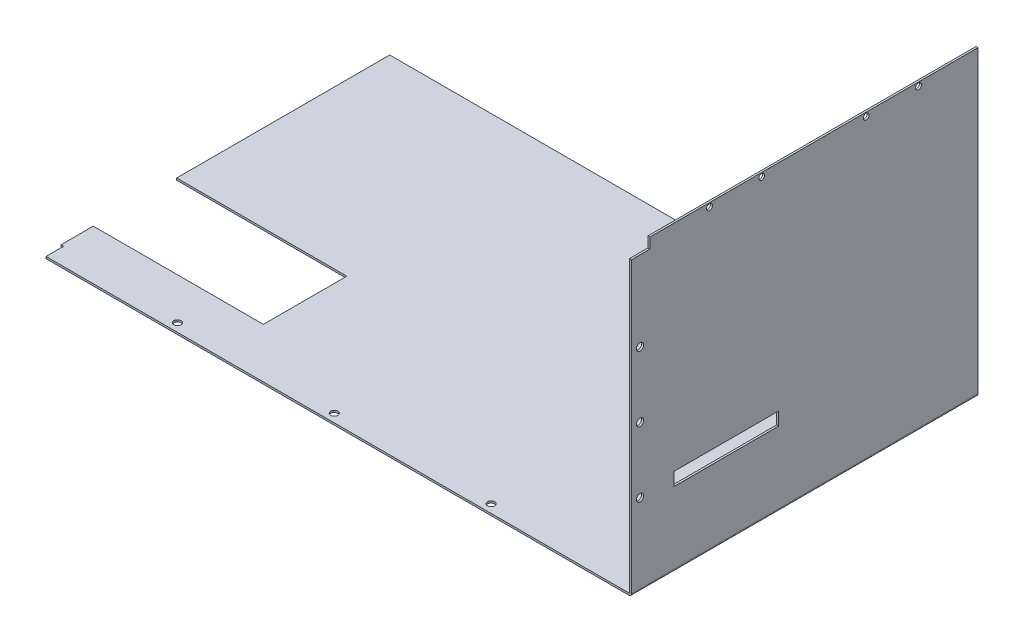
ISO-10303-21;
HEADER;
FILE_DESCRIPTION(('STEP AP214'),'2;1');
FILE_NAME('part.step','',(''),(''),'','','');
FILE_SCHEMA(('AUTOMOTIVE_DESIGN { 1 0 10303 214 1 1 1 1 }'));
ENDSEC;
DATA;
#1=APPLICATION_CONTEXT('core data for automotive mechanical design processes');
#2=APPLICATION_PROTOCOL_DEFINITION('international standard','automotive_design',2000,#1);
#3=PRODUCT_CONTEXT('',#1,'mechanical');
#4=PRODUCT('Part','Part','',(#3));
#5=PRODUCT_RELATED_PRODUCT_CATEGORY('part','',(#4));
#6=PRODUCT_DEFINITION_FORMATION('','',#4);
#7=PRODUCT_DEFINITION_CONTEXT('part definition',#1,'design');
#8=PRODUCT_DEFINITION('design','',#6,#7);
#9=PRODUCT_DEFINITION_SHAPE('','',#8);
#10=(LENGTH_UNIT() NAMED_UNIT(*) SI_UNIT(.MILLI.,.METRE.));
#11=(NAMED_UNIT(*) PLANE_ANGLE_UNIT() SI_UNIT($,.RADIAN.));
#12=(NAMED_UNIT(*) SI_UNIT($,.STERADIAN.) SOLID_ANGLE_UNIT());
#13=UNCERTAINTY_MEASURE_WITH_UNIT(LENGTH_MEASURE(1.E-05),#10,'distance_accuracy_value','');
#14=(GEOMETRIC_REPRESENTATION_CONTEXT(3) GLOBAL_UNCERTAINTY_ASSIGNED_CONTEXT((#13)) GLOBAL_UNIT_ASSIGNED_CONTEXT((#10,
#11,#12)) REPRESENTATION_CONTEXT('',''));
#15=CARTESIAN_POINT('',(0.,0.,0.));
#16=DIRECTION('',(0.,0.,1.));
#17=DIRECTION('',(1.,0.,0.));
#18=AXIS2_PLACEMENT_3D('',#15,#16,#17);
#19=CARTESIAN_POINT('',(0.,0.,265.));
#20=DIRECTION('',(0.,0.,1.));
#21=DIRECTION('',(1.,0.,0.));
#22=AXIS2_PLACEMENT_3D('',#19,#20,#21);
#23=PLANE('',#22);
#24=DIRECTION('',(-1.,0.,0.));
#25=VECTOR('',#24,1.);
#26=CARTESIAN_POINT('',(0.,1.5,265.));
#27=LINE('',#26,#25);
#28=CARTESIAN_POINT('',(-446.67,1.49999999999843,265.));
#29=VERTEX_POINT('',#28);
#30=CARTESIAN_POINT('',(-0.736599999999997,1.5,265.));
#31=VERTEX_POINT('',#30);
#32=EDGE_CURVE('E287',#29,#31,#27,.F.);
#33=ORIENTED_EDGE('',*,*,#32,.F.);
#34=DIRECTION('',(0.,1.,0.));
#35=VECTOR('',#34,1.);
#36=CARTESIAN_POINT('',(-446.67,1.49999999999843,265.));
#37=LINE('',#36,#35);
#38=CARTESIAN_POINT('',(-446.67,-1.55953996962106E-12,265.));
#39=VERTEX_POINT('',#38);
#40=EDGE_CURVE('E210',#29,#39,#37,.F.);
#41=ORIENTED_EDGE('',*,*,#40,.T.);
#42=DIRECTION('',(1.,0.,0.));
#43=VECTOR('',#42,1.);
#44=CARTESIAN_POINT('',(0.,0.,265.));
#45=LINE('',#44,#43);
#46=CARTESIAN_POINT('',(-0.736599999999992,0.,265.));
#47=VERTEX_POINT('',#46);
#48=EDGE_CURVE('E215',#39,#47,#45,.T.);
#49=ORIENTED_EDGE('',*,*,#48,.T.);
#50=DIRECTION('',(0.,-1.,0.));
#51=VECTOR('',#50,1.);
#52=CARTESIAN_POINT('',(-0.736599999999997,1.5,265.));
#53=LINE('',#52,#51);
#54=EDGE_CURVE('E295',#31,#47,#53,.T.);
#55=ORIENTED_EDGE('',*,*,#54,.F.);
#56=EDGE_LOOP('',(#33,#41,#49,#55));
#57=FACE_BOUND('',#56,.T.);
#58=ADVANCED_FACE('F56',(#57),#23,.T.);
#59=CARTESIAN_POINT('',(0.,0.,0.));
#60=DIRECTION('',(0.,-1.,0.));
#61=DIRECTION('',(1.,0.,0.));
#62=AXIS2_PLACEMENT_3D('',#59,#60,#61);
#63=PLANE('',#62);
#64=CARTESIAN_POINT('',(-232.4684,-8.11659080470722E-13,258.618299999999));
#65=DIRECTION('',(0.,-1.,0.));
#66=DIRECTION('',(1.,0.,0.));
#67=AXIS2_PLACEMENT_3D('',#64,#65,#66);
#68=CIRCLE('',#67,2.75000000000001);
#69=CARTESIAN_POINT('',(-229.7184,-8.02057506788903E-13,258.618299999999));
#70=VERTEX_POINT('',#69);
#71=EDGE_CURVE('E225',#70,#70,#68,.T.);
#72=ORIENTED_EDGE('',*,*,#71,.F.);
#73=EDGE_LOOP('',(#72));
#74=FACE_BOUND('',#73,.T.);
#75=CARTESIAN_POINT('',(-112.4684,-3.92681319809546E-13,258.618299999999));
#76=DIRECTION('',(0.,-1.,0.));
#77=DIRECTION('',(1.,0.,0.));
#78=AXIS2_PLACEMENT_3D('',#75,#76,#77);
#79=CIRCLE('',#78,2.75000000000001);
#80=CARTESIAN_POINT('',(-109.7184,-3.83079746127727E-13,258.618299999999));
#81=VERTEX_POINT('',#80);
#82=EDGE_CURVE('E223',#81,#81,#79,.T.);
#83=ORIENTED_EDGE('',*,*,#82,.F.);
#84=EDGE_LOOP('',(#83));
#85=FACE_BOUND('',#84,.T.);
#86=CARTESIAN_POINT('',(-352.4684,-1.2306368411319E-12,258.6183));
#87=DIRECTION('',(0.,-1.,0.));
#88=DIRECTION('',(1.,0.,0.));
#89=AXIS2_PLACEMENT_3D('',#86,#87,#88);
#90=CIRCLE('',#89,2.74999999999998);
#91=CARTESIAN_POINT('',(-349.7184,-1.22103526745008E-12,258.6183));
#92=VERTEX_POINT('',#91);
#93=EDGE_CURVE('E231',#92,#92,#90,.T.);
#94=ORIENTED_EDGE('',*,*,#93,.F.);
#95=EDGE_LOOP('',(#94));
#96=FACE_BOUND('',#95,.T.);
#97=ORIENTED_EDGE('',*,*,#48,.F.);
#98=DIRECTION('',(0.,0.,1.));
#99=VECTOR('',#98,1.);
#100=CARTESIAN_POINT('',(-446.67,-1.55953996962106E-12,0.));
#101=LINE('',#100,#99);
#102=CARTESIAN_POINT('',(-446.67,-1.55953996962106E-12,251.509899070925));
#103=VERTEX_POINT('',#102);
#104=EDGE_CURVE('E203',#39,#103,#101,.F.);
#105=ORIENTED_EDGE('',*,*,#104,.T.);
#106=DIRECTION('',(1.,0.,0.));
#107=VECTOR('',#106,1.);
#108=CARTESIAN_POINT('',(0.,0.,251.509899070925));
#109=LINE('',#108,#107);
#110=CARTESIAN_POINT('',(-448.67,-1.56652293229875E-12,251.509899070925));
#111=VERTEX_POINT('',#110);
#112=EDGE_CURVE('E194',#103,#111,#109,.F.);
#113=ORIENTED_EDGE('',*,*,#112,.T.);
#114=DIRECTION('',(0.,0.,1.));
#115=VECTOR('',#114,1.);
#116=CARTESIAN_POINT('',(-448.67,-1.56652293229875E-12,265.));
#117=LINE('',#116,#115);
#118=CARTESIAN_POINT('',(-448.67,-1.56652293229875E-12,226.83435698));
#119=VERTEX_POINT('',#118);
#120=EDGE_CURVE('E252',#119,#111,#117,.T.);
#121=ORIENTED_EDGE('',*,*,#120,.F.);
#122=DIRECTION('',(1.,0.,0.));
#123=VECTOR('',#122,1.);
#124=CARTESIAN_POINT('',(-448.67,-1.56652293229875E-12,226.83435698));
#125=LINE('',#124,#123);
#126=CARTESIAN_POINT('',(-318.5,-1.11203680642154E-12,226.83435698));
#127=VERTEX_POINT('',#126);
#128=EDGE_CURVE('E254',#119,#127,#125,.T.);
#129=ORIENTED_EDGE('',*,*,#128,.T.);
#130=DIRECTION('',(0.,0.,1.));
#131=VECTOR('',#130,1.);
#132=CARTESIAN_POINT('',(-318.5,-1.11203680642154E-12,265.));
#133=LINE('',#132,#131);
#134=CARTESIAN_POINT('',(-318.5,-1.11203680642154E-12,163.));
#135=VERTEX_POINT('',#134);
#136=EDGE_CURVE('E283',#135,#127,#133,.T.);
#137=ORIENTED_EDGE('',*,*,#136,.F.);
#138=DIRECTION('',(1.,0.,0.));
#139=VECTOR('',#138,1.);
#140=CARTESIAN_POINT('',(-448.67,-1.56652293229875E-12,163.));
#141=LINE('',#140,#139);
#142=CARTESIAN_POINT('',(-448.67,-1.56652293229875E-12,163.));
#143=VERTEX_POINT('',#142);
#144=EDGE_CURVE('E277',#143,#135,#141,.T.);
#145=ORIENTED_EDGE('',*,*,#144,.F.);
#146=DIRECTION('',(0.,0.,1.));
#147=VECTOR('',#146,1.);
#148=CARTESIAN_POINT('',(-448.67,-1.56652293229875E-12,0.));
#149=LINE('',#148,#147);
#150=CARTESIAN_POINT('',(-448.67,-1.56652293229875E-12,0.));
#151=VERTEX_POINT('',#150);
#152=EDGE_CURVE('E265',#151,#143,#149,.T.);
#153=ORIENTED_EDGE('',*,*,#152,.F.);
#154=DIRECTION('',(-1.,0.,0.));
#155=VECTOR('',#154,1.);
#156=CARTESIAN_POINT('',(-318.5,-1.11203680642154E-12,0.));
#157=LINE('',#156,#155);
#158=CARTESIAN_POINT('',(-0.736599999999992,0.,0.));
#159=VERTEX_POINT('',#158);
#160=EDGE_CURVE('E285',#159,#151,#157,.T.);
#161=ORIENTED_EDGE('',*,*,#160,.F.);
#162=DIRECTION('',(0.,0.,1.));
#163=VECTOR('',#162,1.);
#164=CARTESIAN_POINT('',(-0.736599999999992,0.,0.));
#165=LINE('',#164,#163);
#166=EDGE_CURVE('E293',#159,#47,#165,.T.);
#167=ORIENTED_EDGE('',*,*,#166,.T.);
#168=EDGE_LOOP('',(#97,#105,#113,#121,#129,#137,#145,#153,#161,#167));
#169=FACE_BOUND('',#168,.T.);
#170=ADVANCED_FACE('F213',(#74,#85,#96,#169),#63,.T.);
#171=CARTESIAN_POINT('',(0.,1.5,0.));
#172=DIRECTION('',(0.,-1.,0.));
#173=DIRECTION('',(1.,0.,0.));
#174=AXIS2_PLACEMENT_3D('',#171,#172,#173);
#175=PLANE('',#174);
#176=CARTESIAN_POINT('',(-352.4684,1.49999999999877,258.6183));
#177=DIRECTION('',(0.,-1.,0.));
#178=DIRECTION('',(1.,0.,0.));
#179=AXIS2_PLACEMENT_3D('',#176,#177,#178);
#180=CIRCLE('',#179,2.74999999999998);
#181=CARTESIAN_POINT('',(-349.7184,1.49999999999878,258.6183));
#182=VERTEX_POINT('',#181);
#183=EDGE_CURVE('E234',#182,#182,#180,.T.);
#184=ORIENTED_EDGE('',*,*,#183,.T.);
#185=EDGE_LOOP('',(#184));
#186=FACE_BOUND('',#185,.T.);
#187=CARTESIAN_POINT('',(-112.4684,1.49999999999961,258.618299999999));
#188=DIRECTION('',(0.,-1.,0.));
#189=DIRECTION('',(1.,0.,0.));
#190=AXIS2_PLACEMENT_3D('',#187,#188,#189);
#191=CIRCLE('',#190,2.75000000000001);
#192=CARTESIAN_POINT('',(-109.7184,1.49999999999962,258.618299999999));
#193=VERTEX_POINT('',#192);
#194=EDGE_CURVE('E228',#193,#193,#191,.T.);
#195=ORIENTED_EDGE('',*,*,#194,.T.);
#196=EDGE_LOOP('',(#195));
#197=FACE_BOUND('',#196,.T.);
#198=CARTESIAN_POINT('',(-232.4684,1.49999999999919,258.618299999999));
#199=DIRECTION('',(0.,-1.,0.));
#200=DIRECTION('',(1.,0.,0.));
#201=AXIS2_PLACEMENT_3D('',#198,#199,#200);
#202=CIRCLE('',#201,2.75000000000001);
#203=CARTESIAN_POINT('',(-229.7184,1.4999999999992,258.618299999999));
#204=VERTEX_POINT('',#203);
#205=EDGE_CURVE('E235',#204,#204,#202,.T.);
#206=ORIENTED_EDGE('',*,*,#205,.T.);
#207=EDGE_LOOP('',(#206));
#208=FACE_BOUND('',#207,.T.);
#209=DIRECTION('',(0.,0.,-1.));
#210=VECTOR('',#209,1.);
#211=CARTESIAN_POINT('',(-446.67,1.49999999999843,265.));
#212=LINE('',#211,#210);
#213=CARTESIAN_POINT('',(-446.67,1.49999999999843,251.509899070925));
#214=VERTEX_POINT('',#213);
#215=EDGE_CURVE('E204',#29,#214,#212,.T.);
#216=ORIENTED_EDGE('',*,*,#215,.F.);
#217=ORIENTED_EDGE('',*,*,#32,.T.);
#218=DIRECTION('',(0.,0.,-1.));
#219=VECTOR('',#218,1.);
#220=CARTESIAN_POINT('',(-0.736599999999997,1.5,0.));
#221=LINE('',#220,#219);
#222=CARTESIAN_POINT('',(-0.736599999999997,1.5,0.));
#223=VERTEX_POINT('',#222);
#224=EDGE_CURVE('E298',#223,#31,#221,.F.);
#225=ORIENTED_EDGE('',*,*,#224,.F.);
#226=DIRECTION('',(1.,0.,0.));
#227=VECTOR('',#226,1.);
#228=CARTESIAN_POINT('',(0.,1.5,0.));
#229=LINE('',#228,#227);
#230=CARTESIAN_POINT('',(-448.67,1.49999999999843,0.));
#231=VERTEX_POINT('',#230);
#232=EDGE_CURVE('E291',#223,#231,#229,.F.);
#233=ORIENTED_EDGE('',*,*,#232,.T.);
#234=DIRECTION('',(0.,0.,-1.));
#235=VECTOR('',#234,1.);
#236=CARTESIAN_POINT('',(-448.67,1.49999999999843,0.));
#237=LINE('',#236,#235);
#238=CARTESIAN_POINT('',(-448.67,1.49999999999843,163.));
#239=VERTEX_POINT('',#238);
#240=EDGE_CURVE('E269',#239,#231,#237,.T.);
#241=ORIENTED_EDGE('',*,*,#240,.F.);
#242=DIRECTION('',(1.,0.,0.));
#243=VECTOR('',#242,1.);
#244=CARTESIAN_POINT('',(-448.67,1.49999999999843,163.));
#245=LINE('',#244,#243);
#246=CARTESIAN_POINT('',(-318.5,1.49999999999889,163.));
#247=VERTEX_POINT('',#246);
#248=EDGE_CURVE('E272',#239,#247,#245,.T.);
#249=ORIENTED_EDGE('',*,*,#248,.T.);
#250=DIRECTION('',(0.,0.,-1.));
#251=VECTOR('',#250,1.);
#252=CARTESIAN_POINT('',(-318.5,1.49999999999889,0.));
#253=LINE('',#252,#251);
#254=CARTESIAN_POINT('',(-318.5,1.49999999999889,226.83435698));
#255=VERTEX_POINT('',#254);
#256=EDGE_CURVE('E289',#247,#255,#253,.F.);
#257=ORIENTED_EDGE('',*,*,#256,.T.);
#258=DIRECTION('',(1.,0.,0.));
#259=VECTOR('',#258,1.);
#260=CARTESIAN_POINT('',(-448.67,1.49999999999843,226.83435698));
#261=LINE('',#260,#259);
#262=CARTESIAN_POINT('',(-448.67,1.49999999999843,226.83435698));
#263=VERTEX_POINT('',#262);
#264=EDGE_CURVE('E258',#263,#255,#261,.T.);
#265=ORIENTED_EDGE('',*,*,#264,.F.);
#266=DIRECTION('',(0.,0.,-1.));
#267=VECTOR('',#266,1.);
#268=CARTESIAN_POINT('',(-448.67,1.49999999999843,265.));
#269=LINE('',#268,#267);
#270=CARTESIAN_POINT('',(-448.67,1.49999999999843,251.509899070925));
#271=VERTEX_POINT('',#270);
#272=EDGE_CURVE('E248',#271,#263,#269,.T.);
#273=ORIENTED_EDGE('',*,*,#272,.F.);
#274=DIRECTION('',(-1.,0.,0.));
#275=VECTOR('',#274,1.);
#276=CARTESIAN_POINT('',(-446.67,1.49999999999843,251.509899070925));
#277=LINE('',#276,#275);
#278=EDGE_CURVE('E73',#214,#271,#277,.T.);
#279=ORIENTED_EDGE('',*,*,#278,.F.);
#280=EDGE_LOOP('',(#216,#217,#225,#233,#241,#249,#257,#265,#273,#279));
#281=FACE_BOUND('',#280,.T.);
#282=ADVANCED_FACE('F469',(#186,#197,#208,#281),#175,.F.);
#283=CARTESIAN_POINT('',(-448.67,-4.54486125877211E-13,0.));
#284=DIRECTION('',(1.,0.,0.));
#285=DIRECTION('',(0.,0.,-1.));
#286=AXIS2_PLACEMENT_3D('',#283,#284,#285);
#287=PLANE('',#286);
#288=DIRECTION('',(0.,1.,0.));
#289=VECTOR('',#288,1.);
#290=CARTESIAN_POINT('',(-448.67,1.49999999999843,251.509899070925));
#291=LINE('',#290,#289);
#292=EDGE_CURVE('E198',#271,#111,#291,.F.);
#293=ORIENTED_EDGE('',*,*,#292,.F.);
#294=ORIENTED_EDGE('',*,*,#272,.T.);
#295=DIRECTION('',(0.,-1.,0.));
#296=VECTOR('',#295,1.);
#297=CARTESIAN_POINT('',(-448.67,1.49999999999843,226.83435698));
#298=LINE('',#297,#296);
#299=EDGE_CURVE('E250',#263,#119,#298,.T.);
#300=ORIENTED_EDGE('',*,*,#299,.T.);
#301=ORIENTED_EDGE('',*,*,#120,.T.);
#302=EDGE_LOOP('',(#293,#294,#300,#301));
#303=FACE_BOUND('',#302,.T.);
#304=ADVANCED_FACE('F516',(#303),#287,.F.);
#305=CARTESIAN_POINT('',(-318.5,-1.11195774810113E-12,265.));
#306=DIRECTION('',(-1.,0.,0.));
#307=DIRECTION('',(0.,-1.,0.));
#308=AXIS2_PLACEMENT_3D('',#305,#306,#307);
#309=PLANE('',#308);
#310=ORIENTED_EDGE('',*,*,#136,.T.);
#311=DIRECTION('',(0.,-1.,0.));
#312=VECTOR('',#311,1.);
#313=CARTESIAN_POINT('',(-318.5,1.49999999999888,226.83435698));
#314=LINE('',#313,#312);
#315=EDGE_CURVE('E81',#255,#127,#314,.T.);
#316=ORIENTED_EDGE('',*,*,#315,.F.);
#317=ORIENTED_EDGE('',*,*,#256,.F.);
#318=DIRECTION('',(0.,1.,0.));
#319=VECTOR('',#318,1.);
#320=CARTESIAN_POINT('',(-318.5,1.49999999999889,163.));
#321=LINE('',#320,#319);
#322=EDGE_CURVE('E261',#135,#247,#321,.T.);
#323=ORIENTED_EDGE('',*,*,#322,.F.);
#324=EDGE_LOOP('',(#310,#316,#317,#323));
#325=FACE_BOUND('',#324,.T.);
#326=ADVANCED_FACE('F433',(#325),#309,.T.);
#327=CARTESIAN_POINT('',(1.5,0.,265.));
#328=DIRECTION('',(-1.,0.,0.));
#329=DIRECTION('',(0.,0.,1.));
#330=AXIS2_PLACEMENT_3D('',#327,#328,#329);
#331=PLANE('',#330);
#332=CARTESIAN_POINT('',(1.5,228.5,85.5));
#333=DIRECTION('',(1.,0.,0.));
#334=DIRECTION('',(0.,0.,-1.));
#335=AXIS2_PLACEMENT_3D('',#332,#333,#334);
#336=CIRCLE('',#335,2.25);
#337=CARTESIAN_POINT('',(1.5,228.5,83.25));
#338=VERTEX_POINT('',#337);
#339=EDGE_CURVE('E408',#338,#338,#336,.T.);
#340=ORIENTED_EDGE('',*,*,#339,.F.);
#341=EDGE_LOOP('',(#340));
#342=FACE_BOUND('',#341,.T.);
#343=CARTESIAN_POINT('',(1.5,228.5,205.5));
#344=DIRECTION('',(1.,0.,0.));
#345=DIRECTION('',(0.,0.,1.));
#346=AXIS2_PLACEMENT_3D('',#343,#344,#345);
#347=CIRCLE('',#346,2.25000000000001);
#348=CARTESIAN_POINT('',(1.5,228.5,207.75));
#349=VERTEX_POINT('',#348);
#350=EDGE_CURVE('E422',#349,#349,#347,.T.);
#351=ORIENTED_EDGE('',*,*,#350,.F.);
#352=EDGE_LOOP('',(#351));
#353=FACE_BOUND('',#352,.T.);
#354=CARTESIAN_POINT('',(1.5,228.5,165.5));
#355=DIRECTION('',(1.,0.,0.));
#356=DIRECTION('',(0.,0.,1.));
#357=AXIS2_PLACEMENT_3D('',#354,#355,#356);
#358=CIRCLE('',#357,2.24999999999998);
#359=CARTESIAN_POINT('',(1.5,228.5,167.75));
#360=VERTEX_POINT('',#359);
#361=EDGE_CURVE('E419',#360,#360,#358,.T.);
#362=ORIENTED_EDGE('',*,*,#361,.F.);
#363=EDGE_LOOP('',(#362));
#364=FACE_BOUND('',#363,.T.);
#365=CARTESIAN_POINT('',(1.5,228.5,45.5));
#366=DIRECTION('',(1.,0.,0.));
#367=DIRECTION('',(0.,0.,-1.));
#368=AXIS2_PLACEMENT_3D('',#365,#366,#367);
#369=CIRCLE('',#368,2.25);
#370=CARTESIAN_POINT('',(1.5,228.5,43.25));
#371=VERTEX_POINT('',#370);
#372=EDGE_CURVE('E404',#371,#371,#369,.T.);
#373=ORIENTED_EDGE('',*,*,#372,.F.);
#374=EDGE_LOOP('',(#373));
#375=FACE_BOUND('',#374,.T.);
#376=CARTESIAN_POINT('',(1.5,112.5,258.618299999998));
#377=DIRECTION('',(1.,0.,0.));
#378=DIRECTION('',(0.,0.,-1.));
#379=AXIS2_PLACEMENT_3D('',#376,#377,#378);
#380=CIRCLE('',#379,2.74999999999998);
#381=CARTESIAN_POINT('',(1.5,112.5,255.868299999999));
#382=VERTEX_POINT('',#381);
#383=EDGE_CURVE('E236',#382,#382,#380,.T.);
#384=ORIENTED_EDGE('',*,*,#383,.F.);
#385=EDGE_LOOP('',(#384));
#386=FACE_BOUND('',#385,.T.);
#387=CARTESIAN_POINT('',(1.5,62.5000000000001,258.618299999998));
#388=DIRECTION('',(1.,0.,0.));
#389=DIRECTION('',(0.,0.,-1.));
#390=AXIS2_PLACEMENT_3D('',#387,#388,#389);
#391=CIRCLE('',#390,2.74999999999998);
#392=CARTESIAN_POINT('',(1.5,62.5000000000001,255.868299999999));
#393=VERTEX_POINT('',#392);
#394=EDGE_CURVE('E240',#393,#393,#391,.T.);
#395=ORIENTED_EDGE('',*,*,#394,.F.);
#396=EDGE_LOOP('',(#395));
#397=FACE_BOUND('',#396,.T.);
#398=CARTESIAN_POINT('',(1.5,162.5,258.618299999998));
#399=DIRECTION('',(1.,0.,0.));
#400=DIRECTION('',(0.,0.,-1.));
#401=AXIS2_PLACEMENT_3D('',#398,#399,#400);
#402=CIRCLE('',#401,2.74999999999998);
#403=CARTESIAN_POINT('',(1.5,162.5,255.868299999999));
#404=VERTEX_POINT('',#403);
#405=EDGE_CURVE('E243',#404,#404,#402,.T.);
#406=ORIENTED_EDGE('',*,*,#405,.F.);
#407=EDGE_LOOP('',(#406));
#408=FACE_BOUND('',#407,.T.);
#409=DIRECTION('',(0.,0.,1.));
#410=VECTOR('',#409,1.);
#411=CARTESIAN_POINT('',(1.5,56.95061584,265.));
#412=LINE('',#411,#410);
#413=CARTESIAN_POINT('',(1.5,56.95061584,152.56107144));
#414=VERTEX_POINT('',#413);
#415=CARTESIAN_POINT('',(1.5,56.95061584,232.56107144));
#416=VERTEX_POINT('',#415);
#417=EDGE_CURVE('E352',#414,#416,#412,.T.);
#418=ORIENTED_EDGE('',*,*,#417,.T.);
#419=DIRECTION('',(0.,1.,0.));
#420=VECTOR('',#419,1.);
#421=CARTESIAN_POINT('',(1.5,0.,232.56107144));
#422=LINE('',#421,#420);
#423=CARTESIAN_POINT('',(1.5,66.95061584,232.56107144));
#424=VERTEX_POINT('',#423);
#425=EDGE_CURVE('E355',#416,#424,#422,.T.);
#426=ORIENTED_EDGE('',*,*,#425,.T.);
#427=DIRECTION('',(0.,0.,-1.));
#428=VECTOR('',#427,1.);
#429=CARTESIAN_POINT('',(1.5,66.95061584,265.));
#430=LINE('',#429,#428);
#431=CARTESIAN_POINT('',(1.5,66.95061584,152.56107144));
#432=VERTEX_POINT('',#431);
#433=EDGE_CURVE('E340',#424,#432,#430,.T.);
#434=ORIENTED_EDGE('',*,*,#433,.T.);
#435=DIRECTION('',(0.,-1.,0.));
#436=VECTOR('',#435,1.);
#437=CARTESIAN_POINT('',(1.5,0.,152.56107144));
#438=LINE('',#437,#436);
#439=EDGE_CURVE('E349',#432,#414,#438,.T.);
#440=ORIENTED_EDGE('',*,*,#439,.T.);
#441=EDGE_LOOP('',(#418,#426,#434,#440));
#442=FACE_BOUND('',#441,.T.);
#443=DIRECTION('',(0.,0.,1.));
#444=VECTOR('',#443,1.);
#445=CARTESIAN_POINT('',(1.5,2.2366,265.));
#446=LINE('',#445,#444);
#447=CARTESIAN_POINT('',(1.5,2.2366,265.));
#448=VERTEX_POINT('',#447);
#449=CARTESIAN_POINT('',(1.5,2.2366,0.));
#450=VERTEX_POINT('',#449);
#451=EDGE_CURVE('E303',#448,#450,#446,.F.);
#452=ORIENTED_EDGE('',*,*,#451,.T.);
#453=DIRECTION('',(0.,1.,0.));
#454=VECTOR('',#453,1.);
#455=CARTESIAN_POINT('',(1.5,0.,0.));
#456=LINE('',#455,#454);
#457=CARTESIAN_POINT('',(1.5,231.5,0.));
#458=VERTEX_POINT('',#457);
#459=EDGE_CURVE('E377',#450,#458,#456,.T.);
#460=ORIENTED_EDGE('',*,*,#459,.T.);
#461=DIRECTION('',(0.,0.,-1.));
#462=VECTOR('',#461,1.);
#463=CARTESIAN_POINT('',(1.5,231.5,265.));
#464=LINE('',#463,#462);
#465=CARTESIAN_POINT('',(1.5,231.5,251.));
#466=VERTEX_POINT('',#465);
#467=EDGE_CURVE('E13',#466,#458,#464,.T.);
#468=ORIENTED_EDGE('',*,*,#467,.F.);
#469=DIRECTION('',(0.,-1.,0.));
#470=VECTOR('',#469,1.);
#471=CARTESIAN_POINT('',(1.5,0.,251.));
#472=LINE('',#471,#470);
#473=CARTESIAN_POINT('',(1.5,223.5,251.));
#474=VERTEX_POINT('',#473);
#475=EDGE_CURVE('E374',#466,#474,#472,.T.);
#476=ORIENTED_EDGE('',*,*,#475,.T.);
#477=DIRECTION('',(0.,0.,1.));
#478=VECTOR('',#477,1.);
#479=CARTESIAN_POINT('',(1.5,223.5,265.));
#480=LINE('',#479,#478);
#481=CARTESIAN_POINT('',(1.5,223.5,265.));
#482=VERTEX_POINT('',#481);
#483=EDGE_CURVE('E371',#474,#482,#480,.T.);
#484=ORIENTED_EDGE('',*,*,#483,.T.);
#485=DIRECTION('',(0.,1.,0.));
#486=VECTOR('',#485,1.);
#487=CARTESIAN_POINT('',(1.5,0.,265.));
#488=LINE('',#487,#486);
#489=EDGE_CURVE('E378',#448,#482,#488,.T.);
#490=ORIENTED_EDGE('',*,*,#489,.F.);
#491=EDGE_LOOP('',(#452,#460,#468,#476,#484,#490));
#492=FACE_BOUND('',#491,.T.);
#493=ADVANCED_FACE('F58',(#342,#353,#364,#375,#386,#397,#408,#442,#492),#331,.F.);
#494=CARTESIAN_POINT('',(0.,0.,265.));
#495=DIRECTION('',(-1.,0.,0.));
#496=DIRECTION('',(0.,0.,1.));
#497=AXIS2_PLACEMENT_3D('',#494,#495,#496);
#498=PLANE('',#497);
#499=CARTESIAN_POINT('',(0.,228.5,85.5));
#500=DIRECTION('',(-1.,0.,0.));
#501=DIRECTION('',(0.,0.,1.));
#502=AXIS2_PLACEMENT_3D('',#499,#500,#501);
#503=CIRCLE('',#502,2.25);
#504=CARTESIAN_POINT('',(0.,228.5,87.75));
#505=VERTEX_POINT('',#504);
#506=EDGE_CURVE('E60',#505,#505,#503,.T.);
#507=ORIENTED_EDGE('',*,*,#506,.F.);
#508=EDGE_LOOP('',(#507));
#509=FACE_BOUND('',#508,.T.);
#510=CARTESIAN_POINT('',(0.,228.5,205.5));
#511=DIRECTION('',(-1.,0.,0.));
#512=DIRECTION('',(0.,0.,1.));
#513=AXIS2_PLACEMENT_3D('',#510,#511,#512);
#514=CIRCLE('',#513,2.25000000000001);
#515=CARTESIAN_POINT('',(0.,228.5,207.75));
#516=VERTEX_POINT('',#515);
#517=EDGE_CURVE('E407',#516,#516,#514,.T.);
#518=ORIENTED_EDGE('',*,*,#517,.F.);
#519=EDGE_LOOP('',(#518));
#520=FACE_BOUND('',#519,.T.);
#521=CARTESIAN_POINT('',(0.,228.5,165.5));
#522=DIRECTION('',(-1.,0.,0.));
#523=DIRECTION('',(0.,0.,1.));
#524=AXIS2_PLACEMENT_3D('',#521,#522,#523);
#525=CIRCLE('',#524,2.24999999999998);
#526=CARTESIAN_POINT('',(0.,228.5,167.75));
#527=VERTEX_POINT('',#526);
#528=EDGE_CURVE('E405',#527,#527,#525,.T.);
#529=ORIENTED_EDGE('',*,*,#528,.F.);
#530=EDGE_LOOP('',(#529));
#531=FACE_BOUND('',#530,.T.);
#532=CARTESIAN_POINT('',(0.,228.5,45.5));
#533=DIRECTION('',(-1.,0.,0.));
#534=DIRECTION('',(0.,0.,1.));
#535=AXIS2_PLACEMENT_3D('',#532,#533,#534);
#536=CIRCLE('',#535,2.25);
#537=CARTESIAN_POINT('',(0.,228.5,47.75));
#538=VERTEX_POINT('',#537);
#539=EDGE_CURVE('E221',#538,#538,#536,.T.);
#540=ORIENTED_EDGE('',*,*,#539,.F.);
#541=EDGE_LOOP('',(#540));
#542=FACE_BOUND('',#541,.T.);
#543=CARTESIAN_POINT('',(0.,112.5,258.618299999998));
#544=DIRECTION('',(-1.,0.,0.));
#545=DIRECTION('',(0.,0.,1.));
#546=AXIS2_PLACEMENT_3D('',#543,#544,#545);
#547=CIRCLE('',#546,2.74999999999998);
#548=CARTESIAN_POINT('',(0.,112.5,261.368299999998));
#549=VERTEX_POINT('',#548);
#550=EDGE_CURVE('E247',#549,#549,#547,.T.);
#551=ORIENTED_EDGE('',*,*,#550,.F.);
#552=EDGE_LOOP('',(#551));
#553=FACE_BOUND('',#552,.T.);
#554=CARTESIAN_POINT('',(0.,62.5000000000001,258.618299999998));
#555=DIRECTION('',(-1.,0.,0.));
#556=DIRECTION('',(0.,0.,1.));
#557=AXIS2_PLACEMENT_3D('',#554,#555,#556);
#558=CIRCLE('',#557,2.74999999999998);
#559=CARTESIAN_POINT('',(0.,62.5000000000001,261.368299999998));
#560=VERTEX_POINT('',#559);
#561=EDGE_CURVE('E239',#560,#560,#558,.T.);
#562=ORIENTED_EDGE('',*,*,#561,.F.);
#563=EDGE_LOOP('',(#562));
#564=FACE_BOUND('',#563,.T.);
#565=CARTESIAN_POINT('',(0.,162.5,258.618299999998));
#566=DIRECTION('',(-1.,0.,0.));
#567=DIRECTION('',(0.,0.,1.));
#568=AXIS2_PLACEMENT_3D('',#565,#566,#567);
#569=CIRCLE('',#568,2.74999999999998);
#570=CARTESIAN_POINT('',(0.,162.5,261.368299999998));
#571=VERTEX_POINT('',#570);
#572=EDGE_CURVE('E246',#571,#571,#569,.T.);
#573=ORIENTED_EDGE('',*,*,#572,.F.);
#574=EDGE_LOOP('',(#573));
#575=FACE_BOUND('',#574,.T.);
#576=DIRECTION('',(0.,1.,0.));
#577=VECTOR('',#576,1.);
#578=CARTESIAN_POINT('',(0.,56.95061584,232.56107144));
#579=LINE('',#578,#577);
#580=CARTESIAN_POINT('',(0.,56.95061584,232.56107144));
#581=VERTEX_POINT('',#580);
#582=CARTESIAN_POINT('',(0.,66.95061584,232.56107144));
#583=VERTEX_POINT('',#582);
#584=EDGE_CURVE('E324',#581,#583,#579,.T.);
#585=ORIENTED_EDGE('',*,*,#584,.F.);
#586=DIRECTION('',(0.,0.,1.));
#587=VECTOR('',#586,1.);
#588=CARTESIAN_POINT('',(0.,56.95061584,232.56107144));
#589=LINE('',#588,#587);
#590=CARTESIAN_POINT('',(0.,56.95061584,152.56107144));
#591=VERTEX_POINT('',#590);
#592=EDGE_CURVE('E334',#591,#581,#589,.T.);
#593=ORIENTED_EDGE('',*,*,#592,.F.);
#594=DIRECTION('',(0.,-1.,0.));
#595=VECTOR('',#594,1.);
#596=CARTESIAN_POINT('',(0.,56.95061584,152.56107144));
#597=LINE('',#596,#595);
#598=CARTESIAN_POINT('',(0.,66.95061584,152.56107144));
#599=VERTEX_POINT('',#598);
#600=EDGE_CURVE('E331',#599,#591,#597,.T.);
#601=ORIENTED_EDGE('',*,*,#600,.F.);
#602=DIRECTION('',(0.,0.,-1.));
#603=VECTOR('',#602,1.);
#604=CARTESIAN_POINT('',(0.,66.95061584,232.56107144));
#605=LINE('',#604,#603);
#606=EDGE_CURVE('E328',#583,#599,#605,.T.);
#607=ORIENTED_EDGE('',*,*,#606,.F.);
#608=EDGE_LOOP('',(#585,#593,#601,#607));
#609=FACE_BOUND('',#608,.T.);
#610=DIRECTION('',(0.,1.,0.));
#611=VECTOR('',#610,1.);
#612=CARTESIAN_POINT('',(0.,0.,0.));
#613=LINE('',#612,#611);
#614=CARTESIAN_POINT('',(0.,2.2366,0.));
#615=VERTEX_POINT('',#614);
#616=CARTESIAN_POINT('',(0.,231.5,0.));
#617=VERTEX_POINT('',#616);
#618=EDGE_CURVE('E381',#615,#617,#613,.T.);
#619=ORIENTED_EDGE('',*,*,#618,.F.);
#620=DIRECTION('',(0.,0.,1.));
#621=VECTOR('',#620,1.);
#622=CARTESIAN_POINT('',(0.,2.2366,265.));
#623=LINE('',#622,#621);
#624=CARTESIAN_POINT('',(0.,2.2366,265.));
#625=VERTEX_POINT('',#624);
#626=EDGE_CURVE('E316',#625,#615,#623,.F.);
#627=ORIENTED_EDGE('',*,*,#626,.F.);
#628=DIRECTION('',(0.,1.,0.));
#629=VECTOR('',#628,1.);
#630=CARTESIAN_POINT('',(0.,0.,265.));
#631=LINE('',#630,#629);
#632=CARTESIAN_POINT('',(0.,223.5,265.));
#633=VERTEX_POINT('',#632);
#634=EDGE_CURVE('E380',#625,#633,#631,.T.);
#635=ORIENTED_EDGE('',*,*,#634,.T.);
#636=DIRECTION('',(0.,0.,1.));
#637=VECTOR('',#636,1.);
#638=CARTESIAN_POINT('',(0.,223.5,265.));
#639=LINE('',#638,#637);
#640=CARTESIAN_POINT('',(0.,223.5,251.));
#641=VERTEX_POINT('',#640);
#642=EDGE_CURVE('E359',#641,#633,#639,.T.);
#643=ORIENTED_EDGE('',*,*,#642,.F.);
#644=DIRECTION('',(0.,1.,0.));
#645=VECTOR('',#644,1.);
#646=CARTESIAN_POINT('',(0.,223.5,251.));
#647=LINE('',#646,#645);
#648=CARTESIAN_POINT('',(0.,231.5,251.));
#649=VERTEX_POINT('',#648);
#650=EDGE_CURVE('E367',#641,#649,#647,.T.);
#651=ORIENTED_EDGE('',*,*,#650,.T.);
#652=DIRECTION('',(0.,0.,-1.));
#653=VECTOR('',#652,1.);
#654=CARTESIAN_POINT('',(0.,231.5,265.));
#655=LINE('',#654,#653);
#656=EDGE_CURVE('E65',#649,#617,#655,.T.);
#657=ORIENTED_EDGE('',*,*,#656,.T.);
#658=EDGE_LOOP('',(#619,#627,#635,#643,#651,#657));
#659=FACE_BOUND('',#658,.T.);
#660=ADVANCED_FACE('F432',(#509,#520,#531,#542,#553,#564,#575,#609,#659),#498,.T.);
#661=CARTESIAN_POINT('',(0.,0.,265.));
#662=DIRECTION('',(0.,0.,-1.));
#663=DIRECTION('',(-1.,0.,0.));
#664=AXIS2_PLACEMENT_3D('',#661,#662,#663);
#665=PLANE('',#664);
#666=DIRECTION('',(1.,0.,0.));
#667=VECTOR('',#666,1.);
#668=CARTESIAN_POINT('',(0.,2.2366,265.));
#669=LINE('',#668,#667);
#670=EDGE_CURVE('E310',#625,#448,#669,.T.);
#671=ORIENTED_EDGE('',*,*,#670,.T.);
#672=ORIENTED_EDGE('',*,*,#489,.T.);
#673=DIRECTION('',(1.,0.,0.));
#674=VECTOR('',#673,1.);
#675=CARTESIAN_POINT('',(0.,223.5,265.));
#676=LINE('',#675,#674);
#677=EDGE_CURVE('E362',#633,#482,#676,.T.);
#678=ORIENTED_EDGE('',*,*,#677,.F.);
#679=ORIENTED_EDGE('',*,*,#634,.F.);
#680=EDGE_LOOP('',(#671,#672,#678,#679));
#681=FACE_BOUND('',#680,.T.);
#682=ADVANCED_FACE('F479',(#681),#665,.F.);
#683=CARTESIAN_POINT('',(0.,231.5,265.));
#684=DIRECTION('',(0.,1.,0.));
#685=DIRECTION('',(0.,0.,1.));
#686=AXIS2_PLACEMENT_3D('',#683,#684,#685);
#687=PLANE('',#686);
#688=DIRECTION('',(-1.,0.,0.));
#689=VECTOR('',#688,1.);
#690=CARTESIAN_POINT('',(0.,231.5,251.));
#691=LINE('',#690,#689);
#692=EDGE_CURVE('E358',#466,#649,#691,.T.);
#693=ORIENTED_EDGE('',*,*,#692,.F.);
#694=ORIENTED_EDGE('',*,*,#467,.T.);
#695=DIRECTION('',(1.,0.,0.));
#696=VECTOR('',#695,1.);
#697=CARTESIAN_POINT('',(0.,231.5,0.));
#698=LINE('',#697,#696);
#699=EDGE_CURVE('E384',#617,#458,#698,.T.);
#700=ORIENTED_EDGE('',*,*,#699,.F.);
#701=ORIENTED_EDGE('',*,*,#656,.F.);
#702=EDGE_LOOP('',(#693,#694,#700,#701));
#703=FACE_BOUND('',#702,.T.);
#704=ADVANCED_FACE('F493',(#703),#687,.T.);
#705=CARTESIAN_POINT('',(0.,0.,0.));
#706=DIRECTION('',(0.,0.,-1.));
#707=DIRECTION('',(-1.,0.,0.));
#708=AXIS2_PLACEMENT_3D('',#705,#706,#707);
#709=PLANE('',#708);
#710=DIRECTION('',(1.,0.,0.));
#711=VECTOR('',#710,1.);
#712=CARTESIAN_POINT('',(0.,2.2366,0.));
#713=LINE('',#712,#711);
#714=EDGE_CURVE('E321',#615,#450,#713,.T.);
#715=ORIENTED_EDGE('',*,*,#714,.F.);
#716=ORIENTED_EDGE('',*,*,#618,.T.);
#717=ORIENTED_EDGE('',*,*,#699,.T.);
#718=ORIENTED_EDGE('',*,*,#459,.F.);
#719=EDGE_LOOP('',(#715,#716,#717,#718));
#720=FACE_BOUND('',#719,.T.);
#721=ADVANCED_FACE('F494',(#720),#709,.T.);
#722=CARTESIAN_POINT('',(0.,223.5,251.));
#723=DIRECTION('',(0.,0.,-1.));
#724=DIRECTION('',(-1.,0.,0.));
#725=AXIS2_PLACEMENT_3D('',#722,#723,#724);
#726=PLANE('',#725);
#727=ORIENTED_EDGE('',*,*,#692,.T.);
#728=ORIENTED_EDGE('',*,*,#650,.F.);
#729=DIRECTION('',(-1.,0.,0.));
#730=VECTOR('',#729,1.);
#731=CARTESIAN_POINT('',(0.,223.5,251.));
#732=LINE('',#731,#730);
#733=EDGE_CURVE('E365',#474,#641,#732,.T.);
#734=ORIENTED_EDGE('',*,*,#733,.F.);
#735=ORIENTED_EDGE('',*,*,#475,.F.);
#736=EDGE_LOOP('',(#727,#728,#734,#735));
#737=FACE_BOUND('',#736,.T.);
#738=ADVANCED_FACE('F488',(#737),#726,.F.);
#739=CARTESIAN_POINT('',(0.,223.5,0.));
#740=DIRECTION('',(0.,-1.,0.));
#741=DIRECTION('',(0.,0.,-1.));
#742=AXIS2_PLACEMENT_3D('',#739,#740,#741);
#743=PLANE('',#742);
#744=ORIENTED_EDGE('',*,*,#733,.T.);
#745=ORIENTED_EDGE('',*,*,#642,.T.);
#746=ORIENTED_EDGE('',*,*,#677,.T.);
#747=ORIENTED_EDGE('',*,*,#483,.F.);
#748=EDGE_LOOP('',(#744,#745,#746,#747));
#749=FACE_BOUND('',#748,.T.);
#750=ADVANCED_FACE('F484',(#749),#743,.F.);
#751=CARTESIAN_POINT('',(6.,56.95061584,232.56107144));
#752=DIRECTION('',(0.,0.,1.));
#753=DIRECTION('',(1.,0.,0.));
#754=AXIS2_PLACEMENT_3D('',#751,#752,#753);
#755=PLANE('',#754);
#756=DIRECTION('',(-1.,0.,0.));
#757=VECTOR('',#756,1.);
#758=CARTESIAN_POINT('',(6.,56.95061584,232.56107144));
#759=LINE('',#758,#757);
#760=EDGE_CURVE('E338',#416,#581,#759,.T.);
#761=ORIENTED_EDGE('',*,*,#760,.T.);
#762=ORIENTED_EDGE('',*,*,#584,.T.);
#763=DIRECTION('',(-1.,0.,0.));
#764=VECTOR('',#763,1.);
#765=CARTESIAN_POINT('',(6.,66.95061584,232.56107144));
#766=LINE('',#765,#764);
#767=EDGE_CURVE('E337',#424,#583,#766,.T.);
#768=ORIENTED_EDGE('',*,*,#767,.F.);
#769=ORIENTED_EDGE('',*,*,#425,.F.);
#770=EDGE_LOOP('',(#761,#762,#768,#769));
#771=FACE_BOUND('',#770,.T.);
#772=ADVANCED_FACE('F533',(#771),#755,.F.);
#773=CARTESIAN_POINT('',(6.,56.95061584,232.56107144));
#774=DIRECTION('',(0.,-1.,0.));
#775=DIRECTION('',(0.,0.,-1.));
#776=AXIS2_PLACEMENT_3D('',#773,#774,#775);
#777=PLANE('',#776);
#778=DIRECTION('',(-1.,0.,0.));
#779=VECTOR('',#778,1.);
#780=CARTESIAN_POINT('',(6.,56.95061584,152.56107144));
#781=LINE('',#780,#779);
#782=EDGE_CURVE('E341',#414,#591,#781,.T.);
#783=ORIENTED_EDGE('',*,*,#782,.T.);
#784=ORIENTED_EDGE('',*,*,#592,.T.);
#785=ORIENTED_EDGE('',*,*,#760,.F.);
#786=ORIENTED_EDGE('',*,*,#417,.F.);
#787=EDGE_LOOP('',(#783,#784,#785,#786));
#788=FACE_BOUND('',#787,.T.);
#789=ADVANCED_FACE('F529',(#788),#777,.F.);
#790=CARTESIAN_POINT('',(6.,56.95061584,152.56107144));
#791=DIRECTION('',(0.,0.,-1.));
#792=DIRECTION('',(-1.,0.,0.));
#793=AXIS2_PLACEMENT_3D('',#790,#791,#792);
#794=PLANE('',#793);
#795=DIRECTION('',(-1.,0.,0.));
#796=VECTOR('',#795,1.);
#797=CARTESIAN_POINT('',(6.,66.95061584,152.56107144));
#798=LINE('',#797,#796);
#799=EDGE_CURVE('E343',#432,#599,#798,.T.);
#800=ORIENTED_EDGE('',*,*,#799,.T.);
#801=ORIENTED_EDGE('',*,*,#600,.T.);
#802=ORIENTED_EDGE('',*,*,#782,.F.);
#803=ORIENTED_EDGE('',*,*,#439,.F.);
#804=EDGE_LOOP('',(#800,#801,#802,#803));
#805=FACE_BOUND('',#804,.T.);
#806=ADVANCED_FACE('F532',(#805),#794,.F.);
#807=CARTESIAN_POINT('',(6.,66.95061584,232.56107144));
#808=DIRECTION('',(0.,1.,0.));
#809=DIRECTION('',(0.,0.,1.));
#810=AXIS2_PLACEMENT_3D('',#807,#808,#809);
#811=PLANE('',#810);
#812=ORIENTED_EDGE('',*,*,#767,.T.);
#813=ORIENTED_EDGE('',*,*,#606,.T.);
#814=ORIENTED_EDGE('',*,*,#799,.F.);
#815=ORIENTED_EDGE('',*,*,#433,.F.);
#816=EDGE_LOOP('',(#812,#813,#814,#815));
#817=FACE_BOUND('',#816,.T.);
#818=ADVANCED_FACE('F526',(#817),#811,.F.);
#819=CARTESIAN_POINT('',(-0.7366,2.2366,0.));
#820=DIRECTION('',(0.,0.,-1.));
#821=DIRECTION('',(-1.,0.,0.));
#822=AXIS2_PLACEMENT_3D('',#819,#820,#821);
#823=PLANE('',#822);
#824=DIRECTION('',(0.,-1.,0.));
#825=VECTOR('',#824,1.);
#826=CARTESIAN_POINT('',(-0.736599999999976,0.,0.));
#827=LINE('',#826,#825);
#828=EDGE_CURVE('E280',#223,#159,#827,.T.);
#829=ORIENTED_EDGE('',*,*,#828,.F.);
#830=CARTESIAN_POINT('',(-0.7366,2.2366,0.));
#831=DIRECTION('',(0.,0.,1.));
#832=DIRECTION('',(1.,0.,0.));
#833=AXIS2_PLACEMENT_3D('',#830,#831,#832);
#834=CIRCLE('',#833,0.7366);
#835=EDGE_CURVE('E313',#615,#223,#834,.F.);
#836=ORIENTED_EDGE('',*,*,#835,.F.);
#837=ORIENTED_EDGE('',*,*,#714,.T.);
#838=CARTESIAN_POINT('',(-0.7366,2.2366,0.));
#839=DIRECTION('',(0.,0.,1.));
#840=DIRECTION('',(1.,0.,0.));
#841=AXIS2_PLACEMENT_3D('',#838,#839,#840);
#842=CIRCLE('',#841,2.2366);
#843=EDGE_CURVE('E306',#450,#159,#842,.F.);
#844=ORIENTED_EDGE('',*,*,#843,.T.);
#845=EDGE_LOOP('',(#829,#836,#837,#844));
#846=FACE_BOUND('',#845,.T.);
#847=ADVANCED_FACE('F453',(#846),#823,.T.);
#848=CARTESIAN_POINT('',(-0.7366,2.2366,265.));
#849=DIRECTION('',(0.,0.,-1.));
#850=DIRECTION('',(-1.,0.,0.));
#851=AXIS2_PLACEMENT_3D('',#848,#849,#850);
#852=PLANE('',#851);
#853=CARTESIAN_POINT('',(-0.7366,2.2366,265.));
#854=DIRECTION('',(0.,0.,1.));
#855=DIRECTION('',(1.,0.,0.));
#856=AXIS2_PLACEMENT_3D('',#853,#854,#855);
#857=CIRCLE('',#856,0.7366);
#858=EDGE_CURVE('E282',#31,#625,#857,.T.);
#859=ORIENTED_EDGE('',*,*,#858,.F.);
#860=ORIENTED_EDGE('',*,*,#54,.T.);
#861=CARTESIAN_POINT('',(-0.7366,2.2366,265.));
#862=DIRECTION('',(0.,0.,1.));
#863=DIRECTION('',(1.,0.,0.));
#864=AXIS2_PLACEMENT_3D('',#861,#862,#863);
#865=CIRCLE('',#864,2.2366);
#866=EDGE_CURVE('E307',#47,#448,#865,.T.);
#867=ORIENTED_EDGE('',*,*,#866,.T.);
#868=ORIENTED_EDGE('',*,*,#670,.F.);
#869=EDGE_LOOP('',(#859,#860,#867,#868));
#870=FACE_BOUND('',#869,.T.);
#871=ADVANCED_FACE('F475',(#870),#852,.F.);
#872=CARTESIAN_POINT('',(-0.7366,2.2366,265.));
#873=DIRECTION('',(0.,0.,1.));
#874=DIRECTION('',(0.,-1.,0.));
#875=AXIS2_PLACEMENT_3D('',#872,#873,#874);
#876=CYLINDRICAL_SURFACE('',#875,2.2366);
#877=ORIENTED_EDGE('',*,*,#451,.F.);
#878=ORIENTED_EDGE('',*,*,#866,.F.);
#879=ORIENTED_EDGE('',*,*,#166,.F.);
#880=ORIENTED_EDGE('',*,*,#843,.F.);
#881=EDGE_LOOP('',(#877,#878,#879,#880));
#882=FACE_BOUND('',#881,.T.);
#883=ADVANCED_FACE('F456',(#882),#876,.T.);
#884=CARTESIAN_POINT('',(-0.7366,2.2366,265.));
#885=DIRECTION('',(0.,0.,1.));
#886=DIRECTION('',(0.,-1.,0.));
#887=AXIS2_PLACEMENT_3D('',#884,#885,#886);
#888=CYLINDRICAL_SURFACE('',#887,0.7366);
#889=ORIENTED_EDGE('',*,*,#626,.T.);
#890=ORIENTED_EDGE('',*,*,#835,.T.);
#891=ORIENTED_EDGE('',*,*,#224,.T.);
#892=ORIENTED_EDGE('',*,*,#858,.T.);
#893=EDGE_LOOP('',(#889,#890,#891,#892));
#894=FACE_BOUND('',#893,.T.);
#895=ADVANCED_FACE('F466',(#894),#888,.F.);
#896=CARTESIAN_POINT('',(-318.5,-1.11195774810113E-12,0.));
#897=DIRECTION('',(0.,0.,-1.));
#898=DIRECTION('',(-1.,0.,0.));
#899=AXIS2_PLACEMENT_3D('',#896,#897,#898);
#900=PLANE('',#899);
#901=ORIENTED_EDGE('',*,*,#232,.F.);
#902=ORIENTED_EDGE('',*,*,#828,.T.);
#903=ORIENTED_EDGE('',*,*,#160,.T.);
#904=DIRECTION('',(0.,-1.,0.));
#905=VECTOR('',#904,1.);
#906=CARTESIAN_POINT('',(-448.67,1.49999999999843,0.));
#907=LINE('',#906,#905);
#908=EDGE_CURVE('E262',#231,#151,#907,.T.);
#909=ORIENTED_EDGE('',*,*,#908,.F.);
#910=EDGE_LOOP('',(#901,#902,#903,#909));
#911=FACE_BOUND('',#910,.T.);
#912=ADVANCED_FACE('F463',(#911),#900,.T.);
#913=CARTESIAN_POINT('',(-448.67,1.49999999999843,163.));
#914=DIRECTION('',(0.,0.,-1.));
#915=DIRECTION('',(-1.,0.,0.));
#916=AXIS2_PLACEMENT_3D('',#913,#914,#915);
#917=PLANE('',#916);
#918=ORIENTED_EDGE('',*,*,#322,.T.);
#919=ORIENTED_EDGE('',*,*,#248,.F.);
#920=DIRECTION('',(0.,1.,0.));
#921=VECTOR('',#920,1.);
#922=CARTESIAN_POINT('',(-448.67,1.49999999999843,163.));
#923=LINE('',#922,#921);
#924=EDGE_CURVE('E267',#143,#239,#923,.T.);
#925=ORIENTED_EDGE('',*,*,#924,.F.);
#926=ORIENTED_EDGE('',*,*,#144,.T.);
#927=EDGE_LOOP('',(#918,#919,#925,#926));
#928=FACE_BOUND('',#927,.T.);
#929=ADVANCED_FACE('F519',(#928),#917,.F.);
#930=CARTESIAN_POINT('',(-448.67,-4.54486125877211E-13,0.));
#931=DIRECTION('',(-1.,0.,0.));
#932=DIRECTION('',(0.,0.,1.));
#933=AXIS2_PLACEMENT_3D('',#930,#931,#932);
#934=PLANE('',#933);
#935=ORIENTED_EDGE('',*,*,#908,.T.);
#936=ORIENTED_EDGE('',*,*,#152,.T.);
#937=ORIENTED_EDGE('',*,*,#924,.T.);
#938=ORIENTED_EDGE('',*,*,#240,.T.);
#939=EDGE_LOOP('',(#935,#936,#937,#938));
#940=FACE_BOUND('',#939,.T.);
#941=ADVANCED_FACE('F587',(#940),#934,.T.);
#942=CARTESIAN_POINT('',(-448.67,1.49999999999843,226.83435698));
#943=DIRECTION('',(0.,0.,1.));
#944=DIRECTION('',(1.,0.,0.));
#945=AXIS2_PLACEMENT_3D('',#942,#943,#944);
#946=PLANE('',#945);
#947=ORIENTED_EDGE('',*,*,#315,.T.);
#948=ORIENTED_EDGE('',*,*,#128,.F.);
#949=ORIENTED_EDGE('',*,*,#299,.F.);
#950=ORIENTED_EDGE('',*,*,#264,.T.);
#951=EDGE_LOOP('',(#947,#948,#949,#950));
#952=FACE_BOUND('',#951,.T.);
#953=ADVANCED_FACE('F578',(#952),#946,.F.);
#954=CARTESIAN_POINT('',(-18.5,162.5,258.618299999998));
#955=DIRECTION('',(1.,0.,0.));
#956=DIRECTION('',(0.,0.,-1.));
#957=AXIS2_PLACEMENT_3D('',#954,#955,#956);
#958=CYLINDRICAL_SURFACE('',#957,2.74999999999998);
#959=ORIENTED_EDGE('',*,*,#572,.T.);
#960=EDGE_LOOP('',(#959));
#961=FACE_BOUND('',#960,.T.);
#962=ORIENTED_EDGE('',*,*,#405,.T.);
#963=EDGE_LOOP('',(#962));
#964=FACE_BOUND('',#963,.T.);
#965=ADVANCED_FACE('F574',(#961,#964),#958,.F.);
#966=CARTESIAN_POINT('',(-18.5,62.5000000000001,258.618299999998));
#967=DIRECTION('',(1.,0.,0.));
#968=DIRECTION('',(0.,0.,-1.));
#969=AXIS2_PLACEMENT_3D('',#966,#967,#968);
#970=CYLINDRICAL_SURFACE('',#969,2.74999999999998);
#971=ORIENTED_EDGE('',*,*,#561,.T.);
#972=EDGE_LOOP('',(#971));
#973=FACE_BOUND('',#972,.T.);
#974=ORIENTED_EDGE('',*,*,#394,.T.);
#975=EDGE_LOOP('',(#974));
#976=FACE_BOUND('',#975,.T.);
#977=ADVANCED_FACE('F577',(#973,#976),#970,.F.);
#978=CARTESIAN_POINT('',(-18.5,112.5,258.618299999998));
#979=DIRECTION('',(1.,0.,0.));
#980=DIRECTION('',(0.,0.,-1.));
#981=AXIS2_PLACEMENT_3D('',#978,#979,#980);
#982=CYLINDRICAL_SURFACE('',#981,2.74999999999998);
#983=ORIENTED_EDGE('',*,*,#550,.T.);
#984=EDGE_LOOP('',(#983));
#985=FACE_BOUND('',#984,.T.);
#986=ORIENTED_EDGE('',*,*,#383,.T.);
#987=EDGE_LOOP('',(#986));
#988=FACE_BOUND('',#987,.T.);
#989=ADVANCED_FACE('F584',(#985,#988),#982,.F.);
#990=CARTESIAN_POINT('',(-352.4684,9.99999999999877,258.6183));
#991=DIRECTION('',(0.,-1.,0.));
#992=DIRECTION('',(1.,0.,0.));
#993=AXIS2_PLACEMENT_3D('',#990,#991,#992);
#994=CYLINDRICAL_SURFACE('',#993,2.74999999999998);
#995=ORIENTED_EDGE('',*,*,#93,.T.);
#996=EDGE_LOOP('',(#995));
#997=FACE_BOUND('',#996,.T.);
#998=ORIENTED_EDGE('',*,*,#183,.F.);
#999=EDGE_LOOP('',(#998));
#1000=FACE_BOUND('',#999,.T.);
#1001=ADVANCED_FACE('F644',(#997,#1000),#994,.F.);
#1002=CARTESIAN_POINT('',(-112.4684,9.99999999999961,258.618299999999));
#1003=DIRECTION('',(0.,-1.,0.));
#1004=DIRECTION('',(1.,0.,0.));
#1005=AXIS2_PLACEMENT_3D('',#1002,#1003,#1004);
#1006=CYLINDRICAL_SURFACE('',#1005,2.75000000000001);
#1007=ORIENTED_EDGE('',*,*,#82,.T.);
#1008=EDGE_LOOP('',(#1007));
#1009=FACE_BOUND('',#1008,.T.);
#1010=ORIENTED_EDGE('',*,*,#194,.F.);
#1011=EDGE_LOOP('',(#1010));
#1012=FACE_BOUND('',#1011,.T.);
#1013=ADVANCED_FACE('F654',(#1009,#1012),#1006,.F.);
#1014=CARTESIAN_POINT('',(-232.4684,9.99999999999919,258.618299999999));
#1015=DIRECTION('',(0.,-1.,0.));
#1016=DIRECTION('',(1.,0.,0.));
#1017=AXIS2_PLACEMENT_3D('',#1014,#1015,#1016);
#1018=CYLINDRICAL_SURFACE('',#1017,2.75000000000001);
#1019=ORIENTED_EDGE('',*,*,#71,.T.);
#1020=EDGE_LOOP('',(#1019));
#1021=FACE_BOUND('',#1020,.T.);
#1022=ORIENTED_EDGE('',*,*,#205,.F.);
#1023=EDGE_LOOP('',(#1022));
#1024=FACE_BOUND('',#1023,.T.);
#1025=ADVANCED_FACE('F664',(#1021,#1024),#1018,.F.);
#1026=CARTESIAN_POINT('',(-446.67,1.49999999999843,265.));
#1027=DIRECTION('',(-1.,0.,0.));
#1028=DIRECTION('',(0.,0.,-1.));
#1029=AXIS2_PLACEMENT_3D('',#1026,#1027,#1028);
#1030=PLANE('',#1029);
#1031=ORIENTED_EDGE('',*,*,#40,.F.);
#1032=ORIENTED_EDGE('',*,*,#215,.T.);
#1033=DIRECTION('',(0.,1.,0.));
#1034=VECTOR('',#1033,1.);
#1035=CARTESIAN_POINT('',(-446.67,1.49999999999843,251.509899070925));
#1036=LINE('',#1035,#1034);
#1037=EDGE_CURVE('E197',#214,#103,#1036,.F.);
#1038=ORIENTED_EDGE('',*,*,#1037,.T.);
#1039=ORIENTED_EDGE('',*,*,#104,.F.);
#1040=EDGE_LOOP('',(#1031,#1032,#1038,#1039));
#1041=FACE_BOUND('',#1040,.T.);
#1042=ADVANCED_FACE('F207',(#1041),#1030,.T.);
#1043=CARTESIAN_POINT('',(-446.67,1.49999999999843,251.509899070925));
#1044=DIRECTION('',(0.,0.,1.));
#1045=DIRECTION('',(-1.,0.,0.));
#1046=AXIS2_PLACEMENT_3D('',#1043,#1044,#1045);
#1047=PLANE('',#1046);
#1048=ORIENTED_EDGE('',*,*,#1037,.F.);
#1049=ORIENTED_EDGE('',*,*,#278,.T.);
#1050=ORIENTED_EDGE('',*,*,#292,.T.);
#1051=ORIENTED_EDGE('',*,*,#112,.F.);
#1052=EDGE_LOOP('',(#1048,#1049,#1050,#1051));
#1053=FACE_BOUND('',#1052,.T.);
#1054=ADVANCED_FACE('F196',(#1053),#1047,.T.);
#1055=CARTESIAN_POINT('',(-8.5,228.5,45.5));
#1056=DIRECTION('',(1.,0.,0.));
#1057=DIRECTION('',(0.,0.,-1.));
#1058=AXIS2_PLACEMENT_3D('',#1055,#1056,#1057);
#1059=CYLINDRICAL_SURFACE('',#1058,2.25);
#1060=ORIENTED_EDGE('',*,*,#539,.T.);
#1061=EDGE_LOOP('',(#1060));
#1062=FACE_BOUND('',#1061,.T.);
#1063=ORIENTED_EDGE('',*,*,#372,.T.);
#1064=EDGE_LOOP('',(#1063));
#1065=FACE_BOUND('',#1064,.T.);
#1066=ADVANCED_FACE('F717',(#1062,#1065),#1059,.F.);
#1067=CARTESIAN_POINT('',(-8.5,228.5,165.5));
#1068=DIRECTION('',(1.,0.,0.));
#1069=DIRECTION('',(0.,0.,-1.));
#1070=AXIS2_PLACEMENT_3D('',#1067,#1068,#1069);
#1071=CYLINDRICAL_SURFACE('',#1070,2.24999999999998);
#1072=ORIENTED_EDGE('',*,*,#528,.T.);
#1073=EDGE_LOOP('',(#1072));
#1074=FACE_BOUND('',#1073,.T.);
#1075=ORIENTED_EDGE('',*,*,#361,.T.);
#1076=EDGE_LOOP('',(#1075));
#1077=FACE_BOUND('',#1076,.T.);
#1078=ADVANCED_FACE('F723',(#1074,#1077),#1071,.F.);
#1079=CARTESIAN_POINT('',(-8.5,228.5,205.5));
#1080=DIRECTION('',(1.,0.,0.));
#1081=DIRECTION('',(0.,0.,-1.));
#1082=AXIS2_PLACEMENT_3D('',#1079,#1080,#1081);
#1083=CYLINDRICAL_SURFACE('',#1082,2.25000000000001);
#1084=ORIENTED_EDGE('',*,*,#517,.T.);
#1085=EDGE_LOOP('',(#1084));
#1086=FACE_BOUND('',#1085,.T.);
#1087=ORIENTED_EDGE('',*,*,#350,.T.);
#1088=EDGE_LOOP('',(#1087));
#1089=FACE_BOUND('',#1088,.T.);
#1090=ADVANCED_FACE('F731',(#1086,#1089),#1083,.F.);
#1091=CARTESIAN_POINT('',(-8.5,228.5,85.5));
#1092=DIRECTION('',(1.,0.,0.));
#1093=DIRECTION('',(0.,0.,-1.));
#1094=AXIS2_PLACEMENT_3D('',#1091,#1092,#1093);
#1095=CYLINDRICAL_SURFACE('',#1094,2.25);
#1096=ORIENTED_EDGE('',*,*,#506,.T.);
#1097=EDGE_LOOP('',(#1096));
#1098=FACE_BOUND('',#1097,.T.);
#1099=ORIENTED_EDGE('',*,*,#339,.T.);
#1100=EDGE_LOOP('',(#1099));
#1101=FACE_BOUND('',#1100,.T.);
#1102=ADVANCED_FACE('F428',(#1098,#1101),#1095,.F.);
#1103=CLOSED_SHELL('',(#58,#170,#282,#304,#326,#493,#660,#682,#704,#721,#738,#750,#772,#789,
#806,#818,#847,#871,#883,#895,#912,#929,#941,#953,#965,#977,#989,#1001,#1013,#1025,#1042,#1054,
#1066,#1078,#1090,#1102));
#1104=MANIFOLD_SOLID_BREP('B2',#1103);
#1105=ADVANCED_BREP_SHAPE_REPRESENTATION('',(#18,#1104),#14);
#1106=SHAPE_DEFINITION_REPRESENTATION(#9,#1105);
ENDSEC;
END-ISO-10303-21;
